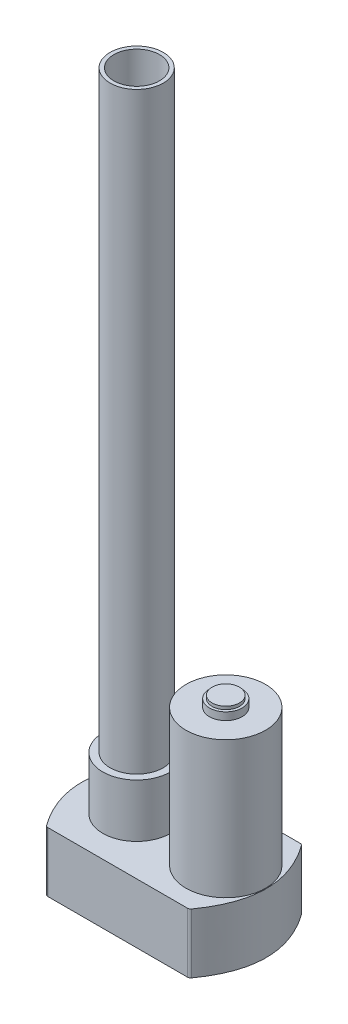
ISO-10303-21;
HEADER;
FILE_DESCRIPTION(('STEP AP214'),'2;1');
FILE_NAME('part.step','',(''),(''),'','','');
FILE_SCHEMA(('AUTOMOTIVE_DESIGN { 1 0 10303 214 1 1 1 1 }'));
ENDSEC;
DATA;
#1=APPLICATION_CONTEXT('core data for automotive mechanical design processes');
#2=APPLICATION_PROTOCOL_DEFINITION('international standard','automotive_design',2000,#1);
#3=PRODUCT_CONTEXT('',#1,'mechanical');
#4=PRODUCT('Part','Part','',(#3));
#5=PRODUCT_RELATED_PRODUCT_CATEGORY('part','',(#4));
#6=PRODUCT_DEFINITION_FORMATION('','',#4);
#7=PRODUCT_DEFINITION_CONTEXT('part definition',#1,'design');
#8=PRODUCT_DEFINITION('design','',#6,#7);
#9=PRODUCT_DEFINITION_SHAPE('','',#8);
#10=(LENGTH_UNIT() NAMED_UNIT(*) SI_UNIT(.MILLI.,.METRE.));
#11=(NAMED_UNIT(*) PLANE_ANGLE_UNIT() SI_UNIT($,.RADIAN.));
#12=(NAMED_UNIT(*) SI_UNIT($,.STERADIAN.) SOLID_ANGLE_UNIT());
#13=UNCERTAINTY_MEASURE_WITH_UNIT(LENGTH_MEASURE(1.E-05),#10,'distance_accuracy_value','');
#14=(GEOMETRIC_REPRESENTATION_CONTEXT(3) GLOBAL_UNCERTAINTY_ASSIGNED_CONTEXT((#13)) GLOBAL_UNIT_ASSIGNED_CONTEXT((#10,
#11,#12)) REPRESENTATION_CONTEXT('',''));
#15=CARTESIAN_POINT('',(0.,0.,0.));
#16=DIRECTION('',(0.,0.,1.));
#17=DIRECTION('',(1.,0.,0.));
#18=AXIS2_PLACEMENT_3D('',#15,#16,#17);
#19=CARTESIAN_POINT('',(42.,-14.3,32.));
#20=CARTESIAN_POINT('',(69.2999999999964,-14.3,-4.99999999999999));
#21=CARTESIAN_POINT('',(42.,-14.3,-42.));
#22=B_SPLINE_CURVE_WITH_KNOTS('',2,(#19,#20,#21),.UNSPECIFIED.,.F.,.F.,(3,3),(0.,1.),.UNSPECIFIED.);
#23=DIRECTION('',(0.,1.,0.));
#24=VECTOR('',#23,1.);
#25=SURFACE_OF_LINEAR_EXTRUSION('',#22,#24);
#26=CARTESIAN_POINT('',(42.6055489101798,-14.3,31.1699828414657));
#27=VERTEX_POINT('',#26);
#28=CARTESIAN_POINT('',(42.6055489101798,-14.3,-41.1699828414657));
#29=VERTEX_POINT('',#28);
#30=EDGE_CURVE('E208',#27,#29,#22,.T.);
#31=ORIENTED_EDGE('',*,*,#30,.T.);
#32=DIRECTION('',(0.,1.,0.));
#33=VECTOR('',#32,1.);
#34=CARTESIAN_POINT('',(42.6055489101798,-14.3,-41.1699828414657));
#35=LINE('',#34,#33);
#36=CARTESIAN_POINT('',(42.6055489101798,25.,-41.1699828414657));
#37=VERTEX_POINT('',#36);
#38=EDGE_CURVE('E114',#29,#37,#35,.T.);
#39=ORIENTED_EDGE('',*,*,#38,.T.);
#40=CARTESIAN_POINT('',(42.,25.,32.));
#41=CARTESIAN_POINT('',(69.2999999999964,25.,-4.99999999999999));
#42=CARTESIAN_POINT('',(42.,25.,-42.));
#43=B_SPLINE_CURVE_WITH_KNOTS('',2,(#40,#41,#42),.UNSPECIFIED.,.F.,.F.,(3,3),(0.,1.),.UNSPECIFIED.);
#44=CARTESIAN_POINT('',(42.6055489101798,25.,31.1699828414657));
#45=VERTEX_POINT('',#44);
#46=EDGE_CURVE('E106',#45,#37,#43,.T.);
#47=ORIENTED_EDGE('',*,*,#46,.F.);
#48=DIRECTION('',(0.,1.,0.));
#49=VECTOR('',#48,1.);
#50=CARTESIAN_POINT('',(42.6055489101798,25.,31.1699828414656));
#51=LINE('',#50,#49);
#52=EDGE_CURVE('E119',#45,#27,#51,.F.);
#53=ORIENTED_EDGE('',*,*,#52,.T.);
#54=EDGE_LOOP('',(#31,#39,#47,#53));
#55=FACE_BOUND('',#54,.T.);
#56=ADVANCED_FACE('F37',(#55),#25,.T.);
#57=CARTESIAN_POINT('',(-52.,-14.3,32.));
#58=DIRECTION('',(0.,0.,1.));
#59=DIRECTION('',(1.,0.,0.));
#60=AXIS2_PLACEMENT_3D('',#57,#58,#59);
#61=PLANE('',#60);
#62=DIRECTION('',(1.,0.,0.));
#63=VECTOR('',#62,1.);
#64=CARTESIAN_POINT('',(-52.,25.,32.));
#65=LINE('',#64,#63);
#66=CARTESIAN_POINT('',(-50.9834699507344,25.,32.));
#67=VERTEX_POINT('',#66);
#68=CARTESIAN_POINT('',(40.9834699507343,25.,32.));
#69=VERTEX_POINT('',#68);
#70=EDGE_CURVE('E108',#67,#69,#65,.T.);
#71=ORIENTED_EDGE('',*,*,#70,.F.);
#72=DIRECTION('',(0.,1.,0.));
#73=VECTOR('',#72,1.);
#74=CARTESIAN_POINT('',(-50.9834699507344,-14.3,32.));
#75=LINE('',#74,#73);
#76=CARTESIAN_POINT('',(-50.9834699507344,-14.3,32.));
#77=VERTEX_POINT('',#76);
#78=EDGE_CURVE('E11',#67,#77,#75,.F.);
#79=ORIENTED_EDGE('',*,*,#78,.T.);
#80=DIRECTION('',(1.,0.,0.));
#81=VECTOR('',#80,1.);
#82=CARTESIAN_POINT('',(-52.,-14.3,32.));
#83=LINE('',#82,#81);
#84=CARTESIAN_POINT('',(40.9834699507343,-14.3,32.));
#85=VERTEX_POINT('',#84);
#86=EDGE_CURVE('E131',#77,#85,#83,.T.);
#87=ORIENTED_EDGE('',*,*,#86,.T.);
#88=DIRECTION('',(0.,1.,0.));
#89=VECTOR('',#88,1.);
#90=CARTESIAN_POINT('',(40.9834699507343,-14.3,32.));
#91=LINE('',#90,#89);
#92=EDGE_CURVE('E45',#85,#69,#91,.T.);
#93=ORIENTED_EDGE('',*,*,#92,.T.);
#94=EDGE_LOOP('',(#71,#79,#87,#93));
#95=FACE_BOUND('',#94,.T.);
#96=ADVANCED_FACE('F156',(#95),#61,.T.);
#97=CARTESIAN_POINT('',(-52.,-14.3,-42.));
#98=CARTESIAN_POINT('',(-79.3,-14.3,-5.00000000000002));
#99=CARTESIAN_POINT('',(-52.,-14.3,32.));
#100=B_SPLINE_CURVE_WITH_KNOTS('',2,(#97,#98,#99),.UNSPECIFIED.,.F.,.F.,(3,3),(0.,1.),.UNSPECIFIED.);
#101=DIRECTION('',(0.,1.,0.));
#102=VECTOR('',#101,1.);
#103=SURFACE_OF_LINEAR_EXTRUSION('',#100,#102);
#104=CARTESIAN_POINT('',(-52.,25.,-42.));
#105=CARTESIAN_POINT('',(-79.3,25.,-5.00000000000002));
#106=CARTESIAN_POINT('',(-52.,25.,32.));
#107=B_SPLINE_CURVE_WITH_KNOTS('',2,(#104,#105,#106),.UNSPECIFIED.,.F.,.F.,(3,3),(0.,1.),.UNSPECIFIED.);
#108=CARTESIAN_POINT('',(-52.6055489101798,25.,-41.1699828414658));
#109=VERTEX_POINT('',#108);
#110=CARTESIAN_POINT('',(-52.6055489101799,25.,31.1699828414658));
#111=VERTEX_POINT('',#110);
#112=EDGE_CURVE('E199',#109,#111,#107,.T.);
#113=ORIENTED_EDGE('',*,*,#112,.F.);
#114=DIRECTION('',(0.,1.,0.));
#115=VECTOR('',#114,1.);
#116=CARTESIAN_POINT('',(-52.6055489101798,25.,-41.1699828414658));
#117=LINE('',#116,#115);
#118=CARTESIAN_POINT('',(-52.6055489101798,-14.3,-41.1699828414658));
#119=VERTEX_POINT('',#118);
#120=EDGE_CURVE('E59',#109,#119,#117,.F.);
#121=ORIENTED_EDGE('',*,*,#120,.T.);
#122=CARTESIAN_POINT('',(-52.6055489101799,-14.3,31.1699828414658));
#123=VERTEX_POINT('',#122);
#124=EDGE_CURVE('E158',#119,#123,#100,.T.);
#125=ORIENTED_EDGE('',*,*,#124,.T.);
#126=DIRECTION('',(0.,1.,0.));
#127=VECTOR('',#126,1.);
#128=CARTESIAN_POINT('',(-52.6055489101799,-14.3,31.1699828414658));
#129=LINE('',#128,#127);
#130=EDGE_CURVE('E151',#123,#111,#129,.T.);
#131=ORIENTED_EDGE('',*,*,#130,.T.);
#132=EDGE_LOOP('',(#113,#121,#125,#131));
#133=FACE_BOUND('',#132,.T.);
#134=ADVANCED_FACE('F236',(#133),#103,.T.);
#135=CARTESIAN_POINT('',(-52.,-14.3,-42.));
#136=DIRECTION('',(0.,0.,-1.));
#137=DIRECTION('',(-1.,0.,0.));
#138=AXIS2_PLACEMENT_3D('',#135,#136,#137);
#139=PLANE('',#138);
#140=DIRECTION('',(-1.,0.,0.));
#141=VECTOR('',#140,1.);
#142=CARTESIAN_POINT('',(-52.,25.,-42.));
#143=LINE('',#142,#141);
#144=CARTESIAN_POINT('',(40.9834699507342,25.,-42.));
#145=VERTEX_POINT('',#144);
#146=CARTESIAN_POINT('',(-50.9834699507344,25.,-42.));
#147=VERTEX_POINT('',#146);
#148=EDGE_CURVE('E122',#145,#147,#143,.T.);
#149=ORIENTED_EDGE('',*,*,#148,.F.);
#150=DIRECTION('',(0.,1.,0.));
#151=VECTOR('',#150,1.);
#152=CARTESIAN_POINT('',(40.9834699507342,-14.3,-42.));
#153=LINE('',#152,#151);
#154=CARTESIAN_POINT('',(40.9834699507342,-14.3,-42.));
#155=VERTEX_POINT('',#154);
#156=EDGE_CURVE('E143',#145,#155,#153,.F.);
#157=ORIENTED_EDGE('',*,*,#156,.T.);
#158=DIRECTION('',(-1.,0.,0.));
#159=VECTOR('',#158,1.);
#160=CARTESIAN_POINT('',(-52.,-14.3,-42.));
#161=LINE('',#160,#159);
#162=CARTESIAN_POINT('',(-50.9834699507344,-14.3,-42.));
#163=VERTEX_POINT('',#162);
#164=EDGE_CURVE('E160',#155,#163,#161,.T.);
#165=ORIENTED_EDGE('',*,*,#164,.T.);
#166=DIRECTION('',(0.,1.,0.));
#167=VECTOR('',#166,1.);
#168=CARTESIAN_POINT('',(-50.9834699507344,-14.3,-42.));
#169=LINE('',#168,#167);
#170=EDGE_CURVE('E140',#163,#147,#169,.T.);
#171=ORIENTED_EDGE('',*,*,#170,.T.);
#172=EDGE_LOOP('',(#149,#157,#165,#171));
#173=FACE_BOUND('',#172,.T.);
#174=ADVANCED_FACE('F219',(#173),#139,.T.);
#175=CARTESIAN_POINT('',(55.6499999999982,-14.3,-4.99999999999999));
#176=DIRECTION('',(0.,1.,0.));
#177=DIRECTION('',(0.,0.,1.));
#178=AXIS2_PLACEMENT_3D('',#175,#176,#177);
#179=PLANE('',#178);
#180=ORIENTED_EDGE('',*,*,#164,.F.);
#181=CARTESIAN_POINT('',(40.9834699507342,-14.3,-40.));
#182=DIRECTION('',(0.,1.,0.));
#183=DIRECTION('',(0.,0.,1.));
#184=AXIS2_PLACEMENT_3D('',#181,#182,#183);
#185=CIRCLE('',#184,2.);
#186=EDGE_CURVE('E149',#155,#29,#185,.F.);
#187=ORIENTED_EDGE('',*,*,#186,.T.);
#188=ORIENTED_EDGE('',*,*,#30,.F.);
#189=CARTESIAN_POINT('',(40.9834699507343,-14.3,30.));
#190=DIRECTION('',(0.,1.,0.));
#191=DIRECTION('',(0.,0.,1.));
#192=AXIS2_PLACEMENT_3D('',#189,#190,#191);
#193=CIRCLE('',#192,2.);
#194=EDGE_CURVE('E126',#27,#85,#193,.F.);
#195=ORIENTED_EDGE('',*,*,#194,.T.);
#196=ORIENTED_EDGE('',*,*,#86,.F.);
#197=CARTESIAN_POINT('',(-50.9834699507344,-14.3,30.));
#198=DIRECTION('',(0.,1.,0.));
#199=DIRECTION('',(0.,0.,1.));
#200=AXIS2_PLACEMENT_3D('',#197,#198,#199);
#201=CIRCLE('',#200,2.);
#202=EDGE_CURVE('E52',#77,#123,#201,.F.);
#203=ORIENTED_EDGE('',*,*,#202,.T.);
#204=ORIENTED_EDGE('',*,*,#124,.F.);
#205=CARTESIAN_POINT('',(-50.9834699507344,-14.3,-40.));
#206=DIRECTION('',(0.,1.,0.));
#207=DIRECTION('',(0.,0.,1.));
#208=AXIS2_PLACEMENT_3D('',#205,#206,#207);
#209=CIRCLE('',#208,2.);
#210=EDGE_CURVE('E147',#119,#163,#209,.F.);
#211=ORIENTED_EDGE('',*,*,#210,.T.);
#212=EDGE_LOOP('',(#180,#187,#188,#195,#196,#203,#204,#211));
#213=FACE_BOUND('',#212,.T.);
#214=ADVANCED_FACE('F245',(#213),#179,.F.);
#215=CARTESIAN_POINT('',(55.6499999999982,25.,-4.99999999999999));
#216=DIRECTION('',(0.,1.,0.));
#217=DIRECTION('',(0.,0.,1.));
#218=AXIS2_PLACEMENT_3D('',#215,#216,#217);
#219=PLANE('',#218);
#220=CARTESIAN_POINT('',(-29.5500000000017,25.,-4.99999999999997));
#221=DIRECTION('',(0.,1.,0.));
#222=DIRECTION('',(0.,0.,1.));
#223=AXIS2_PLACEMENT_3D('',#220,#221,#222);
#224=CIRCLE('',#223,22.25);
#225=CARTESIAN_POINT('',(-29.5500000000017,25.,17.25));
#226=VERTEX_POINT('',#225);
#227=EDGE_CURVE('E181',#226,#226,#224,.T.);
#228=ORIENTED_EDGE('',*,*,#227,.F.);
#229=EDGE_LOOP('',(#228));
#230=FACE_BOUND('',#229,.T.);
#231=CARTESIAN_POINT('',(29.0499999999982,25.,-5.));
#232=DIRECTION('',(0.,1.,0.));
#233=DIRECTION('',(0.,0.,1.));
#234=AXIS2_PLACEMENT_3D('',#231,#232,#233);
#235=CIRCLE('',#234,26.1500000000001);
#236=CARTESIAN_POINT('',(29.0499999999982,25.,21.1500000000001));
#237=VERTEX_POINT('',#236);
#238=EDGE_CURVE('E186',#237,#237,#235,.T.);
#239=ORIENTED_EDGE('',*,*,#238,.F.);
#240=EDGE_LOOP('',(#239));
#241=FACE_BOUND('',#240,.T.);
#242=ORIENTED_EDGE('',*,*,#46,.T.);
#243=CARTESIAN_POINT('',(40.9834699507342,25.,-40.));
#244=DIRECTION('',(0.,1.,0.));
#245=DIRECTION('',(0.,0.,1.));
#246=AXIS2_PLACEMENT_3D('',#243,#244,#245);
#247=CIRCLE('',#246,2.);
#248=EDGE_CURVE('E138',#37,#145,#247,.T.);
#249=ORIENTED_EDGE('',*,*,#248,.T.);
#250=ORIENTED_EDGE('',*,*,#148,.T.);
#251=CARTESIAN_POINT('',(-50.9834699507344,25.,-40.));
#252=DIRECTION('',(0.,1.,0.));
#253=DIRECTION('',(0.,0.,1.));
#254=AXIS2_PLACEMENT_3D('',#251,#252,#253);
#255=CIRCLE('',#254,2.);
#256=EDGE_CURVE('E136',#147,#109,#255,.T.);
#257=ORIENTED_EDGE('',*,*,#256,.T.);
#258=ORIENTED_EDGE('',*,*,#112,.T.);
#259=CARTESIAN_POINT('',(-50.9834699507344,25.,30.));
#260=DIRECTION('',(0.,1.,0.));
#261=DIRECTION('',(0.,0.,1.));
#262=AXIS2_PLACEMENT_3D('',#259,#260,#261);
#263=CIRCLE('',#262,2.);
#264=EDGE_CURVE('E113',#111,#67,#263,.T.);
#265=ORIENTED_EDGE('',*,*,#264,.T.);
#266=ORIENTED_EDGE('',*,*,#70,.T.);
#267=CARTESIAN_POINT('',(40.9834699507343,25.,30.));
#268=DIRECTION('',(0.,1.,0.));
#269=DIRECTION('',(0.,0.,1.));
#270=AXIS2_PLACEMENT_3D('',#267,#268,#269);
#271=CIRCLE('',#270,2.);
#272=EDGE_CURVE('E103',#69,#45,#271,.T.);
#273=ORIENTED_EDGE('',*,*,#272,.T.);
#274=EDGE_LOOP('',(#242,#249,#250,#257,#258,#265,#266,#273));
#275=FACE_BOUND('',#274,.T.);
#276=ADVANCED_FACE('F105',(#230,#241,#275),#219,.T.);
#277=CARTESIAN_POINT('',(29.0499999999982,115.,-5.));
#278=DIRECTION('',(0.,-1.,0.));
#279=DIRECTION('',(0.,0.,-1.));
#280=AXIS2_PLACEMENT_3D('',#277,#278,#279);
#281=CYLINDRICAL_SURFACE('',#280,26.1500000000001);
#282=CARTESIAN_POINT('',(29.0499999999982,115.,-5.));
#283=DIRECTION('',(0.,1.,0.));
#284=DIRECTION('',(0.,0.,1.));
#285=AXIS2_PLACEMENT_3D('',#282,#283,#284);
#286=CIRCLE('',#285,26.1500000000001);
#287=CARTESIAN_POINT('',(29.0499999999982,115.,21.1500000000001));
#288=VERTEX_POINT('',#287);
#289=EDGE_CURVE('E123',#288,#288,#286,.T.);
#290=ORIENTED_EDGE('',*,*,#289,.F.);
#291=EDGE_LOOP('',(#290));
#292=FACE_BOUND('',#291,.T.);
#293=ORIENTED_EDGE('',*,*,#238,.T.);
#294=EDGE_LOOP('',(#293));
#295=FACE_BOUND('',#294,.T.);
#296=ADVANCED_FACE('F252',(#292,#295),#281,.T.);
#297=CARTESIAN_POINT('',(29.0499999999982,115.,-5.));
#298=DIRECTION('',(0.,1.,0.));
#299=DIRECTION('',(0.,0.,1.));
#300=AXIS2_PLACEMENT_3D('',#297,#298,#299);
#301=PLANE('',#300);
#302=CARTESIAN_POINT('',(29.0499999999982,115.,-5.));
#303=DIRECTION('',(0.,1.,0.));
#304=DIRECTION('',(0.,0.,1.));
#305=AXIS2_PLACEMENT_3D('',#302,#303,#304);
#306=CIRCLE('',#305,10.75);
#307=CARTESIAN_POINT('',(29.0499999999982,115.,5.75));
#308=VERTEX_POINT('',#307);
#309=EDGE_CURVE('E168',#308,#308,#306,.T.);
#310=ORIENTED_EDGE('',*,*,#309,.F.);
#311=EDGE_LOOP('',(#310));
#312=FACE_BOUND('',#311,.T.);
#313=ORIENTED_EDGE('',*,*,#289,.T.);
#314=EDGE_LOOP('',(#313));
#315=FACE_BOUND('',#314,.T.);
#316=ADVANCED_FACE('F382',(#312,#315),#301,.T.);
#317=CARTESIAN_POINT('',(29.0499999999982,120.,-5.));
#318=DIRECTION('',(0.,1.,0.));
#319=DIRECTION('',(0.,0.,1.));
#320=AXIS2_PLACEMENT_3D('',#317,#318,#319);
#321=PLANE('',#320);
#322=CARTESIAN_POINT('',(29.0499999999982,120.,-5.));
#323=DIRECTION('',(0.,1.,0.));
#324=DIRECTION('',(0.,0.,1.));
#325=AXIS2_PLACEMENT_3D('',#322,#323,#324);
#326=CIRCLE('',#325,9.00000000000001);
#327=CARTESIAN_POINT('',(29.0499999999982,120.,4.00000000000001));
#328=VERTEX_POINT('',#327);
#329=EDGE_CURVE('E166',#328,#328,#326,.F.);
#330=ORIENTED_EDGE('',*,*,#329,.T.);
#331=EDGE_LOOP('',(#330));
#332=FACE_BOUND('',#331,.T.);
#333=CARTESIAN_POINT('',(29.0499999999982,120.,-5.));
#334=DIRECTION('',(0.,1.,0.));
#335=DIRECTION('',(0.,0.,1.));
#336=AXIS2_PLACEMENT_3D('',#333,#334,#335);
#337=CIRCLE('',#336,10.75);
#338=CARTESIAN_POINT('',(29.0499999999982,120.,5.75));
#339=VERTEX_POINT('',#338);
#340=EDGE_CURVE('E173',#339,#339,#337,.T.);
#341=ORIENTED_EDGE('',*,*,#340,.T.);
#342=EDGE_LOOP('',(#341));
#343=FACE_BOUND('',#342,.T.);
#344=ADVANCED_FACE('F374',(#332,#343),#321,.T.);
#345=CARTESIAN_POINT('',(29.0499999999982,120.,-5.));
#346=DIRECTION('',(0.,-1.,0.));
#347=DIRECTION('',(0.,0.,-1.));
#348=AXIS2_PLACEMENT_3D('',#345,#346,#347);
#349=CYLINDRICAL_SURFACE('',#348,10.75);
#350=ORIENTED_EDGE('',*,*,#340,.F.);
#351=EDGE_LOOP('',(#350));
#352=FACE_BOUND('',#351,.T.);
#353=ORIENTED_EDGE('',*,*,#309,.T.);
#354=EDGE_LOOP('',(#353));
#355=FACE_BOUND('',#354,.T.);
#356=ADVANCED_FACE('F365',(#352,#355),#349,.T.);
#357=CARTESIAN_POINT('',(29.0499999999982,122.,-5.));
#358=DIRECTION('',(0.,-1.,0.));
#359=DIRECTION('',(0.,0.,-1.));
#360=AXIS2_PLACEMENT_3D('',#357,#358,#359);
#361=CYLINDRICAL_SURFACE('',#360,9.00000000000001);
#362=ORIENTED_EDGE('',*,*,#329,.F.);
#363=EDGE_LOOP('',(#362));
#364=FACE_BOUND('',#363,.T.);
#365=CARTESIAN_POINT('',(29.0499999999982,122.,-5.));
#366=DIRECTION('',(0.,1.,0.));
#367=DIRECTION('',(0.,0.,1.));
#368=AXIS2_PLACEMENT_3D('',#365,#366,#367);
#369=CIRCLE('',#368,9.00000000000001);
#370=CARTESIAN_POINT('',(29.0499999999982,122.,4.00000000000001));
#371=VERTEX_POINT('',#370);
#372=EDGE_CURVE('E169',#371,#371,#369,.T.);
#373=ORIENTED_EDGE('',*,*,#372,.F.);
#374=EDGE_LOOP('',(#373));
#375=FACE_BOUND('',#374,.T.);
#376=ADVANCED_FACE('F358',(#364,#375),#361,.T.);
#377=CARTESIAN_POINT('',(29.0499999999982,122.,-5.));
#378=DIRECTION('',(0.,1.,0.));
#379=DIRECTION('',(0.,0.,1.));
#380=AXIS2_PLACEMENT_3D('',#377,#378,#379);
#381=PLANE('',#380);
#382=ORIENTED_EDGE('',*,*,#372,.T.);
#383=EDGE_LOOP('',(#382));
#384=FACE_BOUND('',#383,.T.);
#385=ADVANCED_FACE('F349',(#384),#381,.T.);
#386=CARTESIAN_POINT('',(-29.5500000000017,60.,-4.99999999999997));
#387=DIRECTION('',(0.,1.,0.));
#388=DIRECTION('',(0.,0.,1.));
#389=AXIS2_PLACEMENT_3D('',#386,#387,#388);
#390=PLANE('',#389);
#391=CARTESIAN_POINT('',(-29.5500000000017,60.,-4.99999999999997));
#392=DIRECTION('',(0.,1.,0.));
#393=DIRECTION('',(0.,0.,1.));
#394=AXIS2_PLACEMENT_3D('',#391,#392,#393);
#395=CIRCLE('',#394,22.25);
#396=CARTESIAN_POINT('',(-29.5500000000017,60.,17.25));
#397=VERTEX_POINT('',#396);
#398=EDGE_CURVE('E176',#397,#397,#395,.T.);
#399=ORIENTED_EDGE('',*,*,#398,.T.);
#400=EDGE_LOOP('',(#399));
#401=FACE_BOUND('',#400,.T.);
#402=CARTESIAN_POINT('',(-29.5500000000017,60.,-4.99999999999997));
#403=DIRECTION('',(0.,1.,0.));
#404=DIRECTION('',(0.,0.,1.));
#405=AXIS2_PLACEMENT_3D('',#402,#403,#404);
#406=CIRCLE('',#405,17.5);
#407=CARTESIAN_POINT('',(-29.5500000000017,60.,12.5));
#408=VERTEX_POINT('',#407);
#409=EDGE_CURVE('E432',#408,#408,#406,.T.);
#410=ORIENTED_EDGE('',*,*,#409,.F.);
#411=EDGE_LOOP('',(#410));
#412=FACE_BOUND('',#411,.T.);
#413=ADVANCED_FACE('F341',(#401,#412),#390,.T.);
#414=CARTESIAN_POINT('',(-29.5500000000017,60.,-4.99999999999997));
#415=DIRECTION('',(0.,-1.,0.));
#416=DIRECTION('',(0.,0.,-1.));
#417=AXIS2_PLACEMENT_3D('',#414,#415,#416);
#418=CYLINDRICAL_SURFACE('',#417,22.25);
#419=ORIENTED_EDGE('',*,*,#398,.F.);
#420=EDGE_LOOP('',(#419));
#421=FACE_BOUND('',#420,.T.);
#422=ORIENTED_EDGE('',*,*,#227,.T.);
#423=EDGE_LOOP('',(#422));
#424=FACE_BOUND('',#423,.T.);
#425=ADVANCED_FACE('F333',(#421,#424),#418,.T.);
#426=CARTESIAN_POINT('',(-29.5500000000017,450.,-4.99999999999997));
#427=DIRECTION('',(0.,1.,0.));
#428=DIRECTION('',(0.,0.,1.));
#429=AXIS2_PLACEMENT_3D('',#426,#427,#428);
#430=PLANE('',#429);
#431=CARTESIAN_POINT('',(-29.5500000000017,450.,-4.99999999999997));
#432=DIRECTION('',(0.,1.,0.));
#433=DIRECTION('',(0.,0.,1.));
#434=AXIS2_PLACEMENT_3D('',#431,#432,#433);
#435=CIRCLE('',#434,17.5);
#436=CARTESIAN_POINT('',(-29.5500000000017,450.,12.5));
#437=VERTEX_POINT('',#436);
#438=EDGE_CURVE('E433',#437,#437,#435,.T.);
#439=ORIENTED_EDGE('',*,*,#438,.T.);
#440=EDGE_LOOP('',(#439));
#441=FACE_BOUND('',#440,.T.);
#442=CARTESIAN_POINT('',(-29.5500000000017,450.,-4.99999999999997));
#443=DIRECTION('',(0.,1.,0.));
#444=DIRECTION('',(0.,0.,1.));
#445=AXIS2_PLACEMENT_3D('',#442,#443,#444);
#446=CIRCLE('',#445,15.);
#447=CARTESIAN_POINT('',(-29.5500000000017,450.,10.));
#448=VERTEX_POINT('',#447);
#449=EDGE_CURVE('E437',#448,#448,#446,.T.);
#450=ORIENTED_EDGE('',*,*,#449,.F.);
#451=EDGE_LOOP('',(#450));
#452=FACE_BOUND('',#451,.T.);
#453=ADVANCED_FACE('F325',(#441,#452),#430,.T.);
#454=CARTESIAN_POINT('',(-29.5500000000017,450.,-4.99999999999997));
#455=DIRECTION('',(0.,-1.,0.));
#456=DIRECTION('',(0.,0.,-1.));
#457=AXIS2_PLACEMENT_3D('',#454,#455,#456);
#458=CYLINDRICAL_SURFACE('',#457,17.5);
#459=ORIENTED_EDGE('',*,*,#409,.T.);
#460=EDGE_LOOP('',(#459));
#461=FACE_BOUND('',#460,.T.);
#462=ORIENTED_EDGE('',*,*,#438,.F.);
#463=EDGE_LOOP('',(#462));
#464=FACE_BOUND('',#463,.T.);
#465=ADVANCED_FACE('F318',(#461,#464),#458,.T.);
#466=CARTESIAN_POINT('',(-29.5500000000017,450.,-4.99999999999997));
#467=DIRECTION('',(0.,-1.,0.));
#468=DIRECTION('',(0.,0.,-1.));
#469=AXIS2_PLACEMENT_3D('',#466,#467,#468);
#470=CYLINDRICAL_SURFACE('',#469,15.);
#471=ORIENTED_EDGE('',*,*,#449,.T.);
#472=EDGE_LOOP('',(#471));
#473=FACE_BOUND('',#472,.T.);
#474=CARTESIAN_POINT('',(-29.5500000000017,25.,-4.99999999999997));
#475=DIRECTION('',(0.,1.,0.));
#476=DIRECTION('',(0.,0.,1.));
#477=AXIS2_PLACEMENT_3D('',#474,#475,#476);
#478=CIRCLE('',#477,15.);
#479=CARTESIAN_POINT('',(-29.5500000000017,25.,10.));
#480=VERTEX_POINT('',#479);
#481=EDGE_CURVE('E127',#480,#480,#478,.F.);
#482=ORIENTED_EDGE('',*,*,#481,.T.);
#483=EDGE_LOOP('',(#482));
#484=FACE_BOUND('',#483,.T.);
#485=ADVANCED_FACE('F310',(#473,#484),#470,.F.);
#486=ORIENTED_EDGE('',*,*,#481,.F.);
#487=EDGE_LOOP('',(#486));
#488=FACE_BOUND('',#487,.T.);
#489=ADVANCED_FACE('F225',(#488),#219,.T.);
#490=CARTESIAN_POINT('',(40.9834699507342,5.35,-40.));
#491=DIRECTION('',(0.,1.,0.));
#492=DIRECTION('',(0.,0.,1.));
#493=AXIS2_PLACEMENT_3D('',#490,#491,#492);
#494=CYLINDRICAL_SURFACE('',#493,2.);
#495=ORIENTED_EDGE('',*,*,#186,.F.);
#496=ORIENTED_EDGE('',*,*,#156,.F.);
#497=ORIENTED_EDGE('',*,*,#248,.F.);
#498=ORIENTED_EDGE('',*,*,#38,.F.);
#499=EDGE_LOOP('',(#495,#496,#497,#498));
#500=FACE_BOUND('',#499,.T.);
#501=ADVANCED_FACE('F221',(#500),#494,.T.);
#502=CARTESIAN_POINT('',(-50.9834699507344,5.35,-40.));
#503=DIRECTION('',(0.,1.,0.));
#504=DIRECTION('',(0.,0.,1.));
#505=AXIS2_PLACEMENT_3D('',#502,#503,#504);
#506=CYLINDRICAL_SURFACE('',#505,2.);
#507=ORIENTED_EDGE('',*,*,#210,.F.);
#508=ORIENTED_EDGE('',*,*,#120,.F.);
#509=ORIENTED_EDGE('',*,*,#256,.F.);
#510=ORIENTED_EDGE('',*,*,#170,.F.);
#511=EDGE_LOOP('',(#507,#508,#509,#510));
#512=FACE_BOUND('',#511,.T.);
#513=ADVANCED_FACE('F224',(#512),#506,.T.);
#514=CARTESIAN_POINT('',(-50.9834699507344,5.35,30.));
#515=DIRECTION('',(0.,1.,0.));
#516=DIRECTION('',(0.,0.,1.));
#517=AXIS2_PLACEMENT_3D('',#514,#515,#516);
#518=CYLINDRICAL_SURFACE('',#517,2.);
#519=ORIENTED_EDGE('',*,*,#202,.F.);
#520=ORIENTED_EDGE('',*,*,#78,.F.);
#521=ORIENTED_EDGE('',*,*,#264,.F.);
#522=ORIENTED_EDGE('',*,*,#130,.F.);
#523=EDGE_LOOP('',(#519,#520,#521,#522));
#524=FACE_BOUND('',#523,.T.);
#525=ADVANCED_FACE('F228',(#524),#518,.T.);
#526=CARTESIAN_POINT('',(40.9834699507343,5.35,30.));
#527=DIRECTION('',(0.,1.,0.));
#528=DIRECTION('',(0.,0.,1.));
#529=AXIS2_PLACEMENT_3D('',#526,#527,#528);
#530=CYLINDRICAL_SURFACE('',#529,2.);
#531=ORIENTED_EDGE('',*,*,#194,.F.);
#532=ORIENTED_EDGE('',*,*,#52,.F.);
#533=ORIENTED_EDGE('',*,*,#272,.F.);
#534=ORIENTED_EDGE('',*,*,#92,.F.);
#535=EDGE_LOOP('',(#531,#532,#533,#534));
#536=FACE_BOUND('',#535,.T.);
#537=ADVANCED_FACE('F39',(#536),#530,.T.);
#538=CLOSED_SHELL('',(#56,#96,#134,#174,#214,#276,#296,#316,#344,#356,#376,#385,#413,#425,#453,
#465,#485,#489,#501,#513,#525,#537));
#539=MANIFOLD_SOLID_BREP('B2',#538);
#540=ADVANCED_BREP_SHAPE_REPRESENTATION('',(#18,#539),#14);
#541=SHAPE_DEFINITION_REPRESENTATION(#9,#540);
ENDSEC;
END-ISO-10303-21;
